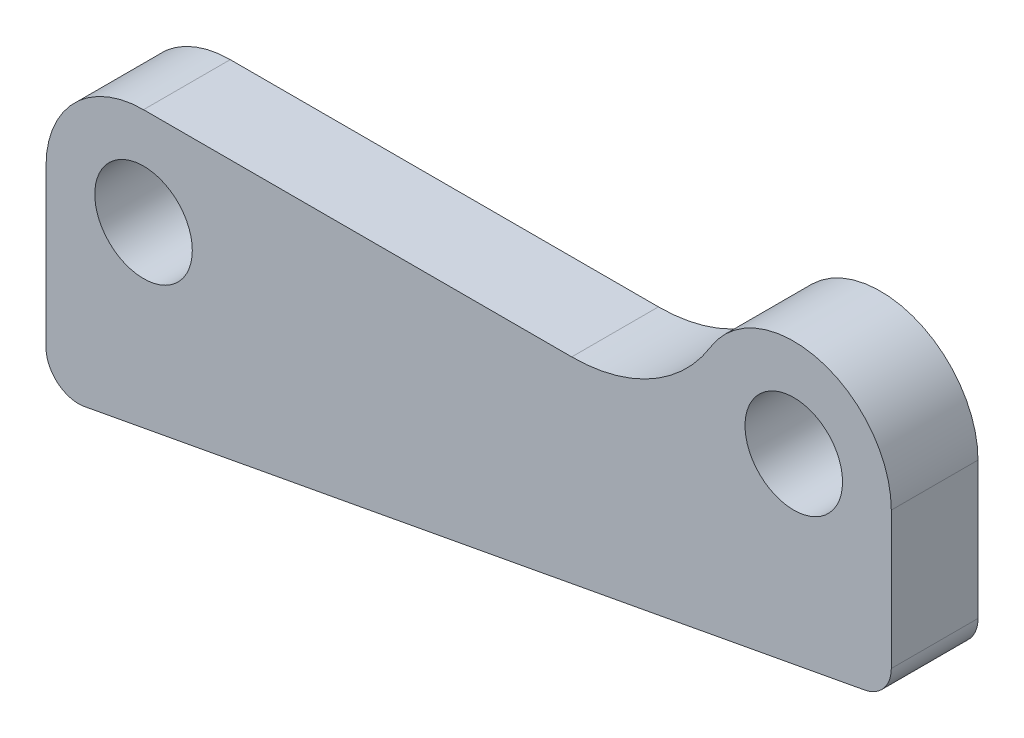
ISO-10303-21;
HEADER;
FILE_DESCRIPTION(('STEP AP214'),'2;1');
FILE_NAME('part.step','',(''),(''),'','','');
FILE_SCHEMA(('AUTOMOTIVE_DESIGN { 1 0 10303 214 1 1 1 1 }'));
ENDSEC;
DATA;
#1=APPLICATION_CONTEXT('core data for automotive mechanical design processes');
#2=APPLICATION_PROTOCOL_DEFINITION('international standard','automotive_design',2000,#1);
#3=PRODUCT_CONTEXT('',#1,'mechanical');
#4=PRODUCT('Part','Part','',(#3));
#5=PRODUCT_RELATED_PRODUCT_CATEGORY('part','',(#4));
#6=PRODUCT_DEFINITION_FORMATION('','',#4);
#7=PRODUCT_DEFINITION_CONTEXT('part definition',#1,'design');
#8=PRODUCT_DEFINITION('design','',#6,#7);
#9=PRODUCT_DEFINITION_SHAPE('','',#8);
#10=(LENGTH_UNIT() NAMED_UNIT(*) SI_UNIT(.MILLI.,.METRE.));
#11=(NAMED_UNIT(*) PLANE_ANGLE_UNIT() SI_UNIT($,.RADIAN.));
#12=(NAMED_UNIT(*) SI_UNIT($,.STERADIAN.) SOLID_ANGLE_UNIT());
#13=UNCERTAINTY_MEASURE_WITH_UNIT(LENGTH_MEASURE(1.E-05),#10,'distance_accuracy_value','');
#14=(GEOMETRIC_REPRESENTATION_CONTEXT(3) GLOBAL_UNCERTAINTY_ASSIGNED_CONTEXT((#13)) GLOBAL_UNIT_ASSIGNED_CONTEXT((#10,
#11,#12)) REPRESENTATION_CONTEXT('',''));
#15=CARTESIAN_POINT('',(0.,0.,0.));
#16=DIRECTION('',(0.,0.,1.));
#17=DIRECTION('',(1.,0.,0.));
#18=AXIS2_PLACEMENT_3D('',#15,#16,#17);
#19=CARTESIAN_POINT('',(-6.,-14.5,8.));
#20=DIRECTION('',(0.,0.,1.));
#21=DIRECTION('',(1.,0.,0.));
#22=AXIS2_PLACEMENT_3D('',#19,#20,#21);
#23=PLANE('',#22);
#24=CARTESIAN_POINT('',(0.,0.,8.));
#25=DIRECTION('',(0.,0.,1.));
#26=DIRECTION('',(1.,0.,0.));
#27=AXIS2_PLACEMENT_3D('',#24,#25,#26);
#28=CIRCLE('',#27,4.5);
#29=CARTESIAN_POINT('',(4.5,0.,8.));
#30=VERTEX_POINT('',#29);
#31=EDGE_CURVE('E146',#30,#30,#28,.T.);
#32=ORIENTED_EDGE('',*,*,#31,.F.);
#33=EDGE_LOOP('',(#32));
#34=FACE_BOUND('',#33,.T.);
#35=CARTESIAN_POINT('',(-6.,-14.5,8.));
#36=DIRECTION('',(0.,0.,1.));
#37=DIRECTION('',(1.,0.,0.));
#38=AXIS2_PLACEMENT_3D('',#35,#36,#37);
#39=CIRCLE('',#38,3.);
#40=CARTESIAN_POINT('',(-9.,-14.5,8.));
#41=VERTEX_POINT('',#40);
#42=CARTESIAN_POINT('',(-5.45329342352354,-17.4497647226919,8.));
#43=VERTEX_POINT('',#42);
#44=EDGE_CURVE('E159',#41,#43,#39,.T.);
#45=ORIENTED_EDGE('',*,*,#44,.T.);
#46=DIRECTION('',(0.983254907563954,0.182235525492151,0.));
#47=VECTOR('',#46,1.);
#48=CARTESIAN_POINT('',(-5.45329342352354,-17.4497647226919,8.));
#49=LINE('',#48,#47);
#50=CARTESIAN_POINT('',(66.5467065764764,-4.1053534876211,8.));
#51=VERTEX_POINT('',#50);
#52=EDGE_CURVE('E102',#43,#51,#49,.T.);
#53=ORIENTED_EDGE('',*,*,#52,.T.);
#54=CARTESIAN_POINT('',(66.,-1.15558876492923,8.));
#55=DIRECTION('',(0.,0.,1.));
#56=DIRECTION('',(1.,0.,0.));
#57=AXIS2_PLACEMENT_3D('',#54,#55,#56);
#58=CIRCLE('',#57,3.00000000000001);
#59=CARTESIAN_POINT('',(69.,-1.15558876492923,8.));
#60=VERTEX_POINT('',#59);
#61=EDGE_CURVE('E177',#51,#60,#58,.T.);
#62=ORIENTED_EDGE('',*,*,#61,.T.);
#63=DIRECTION('',(0.,1.,0.));
#64=VECTOR('',#63,1.);
#65=CARTESIAN_POINT('',(69.,-1.15558876492923,8.));
#66=LINE('',#65,#64);
#67=CARTESIAN_POINT('',(69.,11.5,8.));
#68=VERTEX_POINT('',#67);
#69=EDGE_CURVE('E194',#60,#68,#66,.T.);
#70=ORIENTED_EDGE('',*,*,#69,.T.);
#71=CARTESIAN_POINT('',(60.,11.5,8.));
#72=DIRECTION('',(0.,0.,1.));
#73=DIRECTION('',(1.,0.,0.));
#74=AXIS2_PLACEMENT_3D('',#71,#72,#73);
#75=CIRCLE('',#74,8.99999999999999);
#76=CARTESIAN_POINT('',(52.3170745317946,16.1875,8.));
#77=VERTEX_POINT('',#76);
#78=EDGE_CURVE('E193',#68,#77,#75,.T.);
#79=ORIENTED_EDGE('',*,*,#78,.T.);
#80=CARTESIAN_POINT('',(39.5121987514521,24.,8.));
#81=DIRECTION('',(0.,0.,-1.));
#82=DIRECTION('',(-1.,0.,0.));
#83=AXIS2_PLACEMENT_3D('',#80,#81,#82);
#84=CIRCLE('',#83,15.);
#85=CARTESIAN_POINT('',(39.5121987514521,9.00000000000001,8.));
#86=VERTEX_POINT('',#85);
#87=EDGE_CURVE('E124',#77,#86,#84,.T.);
#88=ORIENTED_EDGE('',*,*,#87,.T.);
#89=DIRECTION('',(-1.,0.,0.));
#90=VECTOR('',#89,1.);
#91=CARTESIAN_POINT('',(39.5121987514521,9.00000000000001,8.));
#92=LINE('',#91,#90);
#93=CARTESIAN_POINT('',(0.,9.,8.));
#94=VERTEX_POINT('',#93);
#95=EDGE_CURVE('E118',#86,#94,#92,.T.);
#96=ORIENTED_EDGE('',*,*,#95,.T.);
#97=CARTESIAN_POINT('',(0.,0.,8.));
#98=DIRECTION('',(0.,0.,1.));
#99=DIRECTION('',(1.,0.,0.));
#100=AXIS2_PLACEMENT_3D('',#97,#98,#99);
#101=CIRCLE('',#100,9.);
#102=CARTESIAN_POINT('',(-9.,0.,8.));
#103=VERTEX_POINT('',#102);
#104=EDGE_CURVE('E122',#94,#103,#101,.T.);
#105=ORIENTED_EDGE('',*,*,#104,.T.);
#106=DIRECTION('',(0.,-1.,0.));
#107=VECTOR('',#106,1.);
#108=CARTESIAN_POINT('',(-9.,0.,8.));
#109=LINE('',#108,#107);
#110=EDGE_CURVE('E56',#103,#41,#109,.T.);
#111=ORIENTED_EDGE('',*,*,#110,.T.);
#112=EDGE_LOOP('',(#45,#53,#62,#70,#79,#88,#96,#105,#111));
#113=FACE_BOUND('',#112,.T.);
#114=CARTESIAN_POINT('',(60.,11.5,8.));
#115=DIRECTION('',(0.,0.,1.));
#116=DIRECTION('',(1.,0.,0.));
#117=AXIS2_PLACEMENT_3D('',#114,#115,#116);
#118=CIRCLE('',#117,4.5);
#119=CARTESIAN_POINT('',(64.5,11.5,8.));
#120=VERTEX_POINT('',#119);
#121=EDGE_CURVE('E204',#120,#120,#118,.T.);
#122=ORIENTED_EDGE('',*,*,#121,.F.);
#123=EDGE_LOOP('',(#122));
#124=FACE_BOUND('',#123,.T.);
#125=ADVANCED_FACE('F39',(#34,#113,#124),#23,.T.);
#126=CARTESIAN_POINT('',(-6.,-14.5,0.));
#127=DIRECTION('',(0.,0.,1.));
#128=DIRECTION('',(1.,0.,0.));
#129=AXIS2_PLACEMENT_3D('',#126,#127,#128);
#130=PLANE('',#129);
#131=CARTESIAN_POINT('',(0.,0.,0.));
#132=DIRECTION('',(0.,0.,1.));
#133=DIRECTION('',(1.,0.,0.));
#134=AXIS2_PLACEMENT_3D('',#131,#132,#133);
#135=CIRCLE('',#134,4.5);
#136=CARTESIAN_POINT('',(4.5,0.,0.));
#137=VERTEX_POINT('',#136);
#138=EDGE_CURVE('E201',#137,#137,#135,.T.);
#139=ORIENTED_EDGE('',*,*,#138,.T.);
#140=EDGE_LOOP('',(#139));
#141=FACE_BOUND('',#140,.T.);
#142=CARTESIAN_POINT('',(-6.,-14.5,0.));
#143=DIRECTION('',(0.,0.,1.));
#144=DIRECTION('',(1.,0.,0.));
#145=AXIS2_PLACEMENT_3D('',#142,#143,#144);
#146=CIRCLE('',#145,3.);
#147=CARTESIAN_POINT('',(-9.,-14.5,0.));
#148=VERTEX_POINT('',#147);
#149=CARTESIAN_POINT('',(-5.45329342352354,-17.4497647226919,0.));
#150=VERTEX_POINT('',#149);
#151=EDGE_CURVE('E142',#148,#150,#146,.T.);
#152=ORIENTED_EDGE('',*,*,#151,.F.);
#153=DIRECTION('',(0.,-1.,0.));
#154=VECTOR('',#153,1.);
#155=CARTESIAN_POINT('',(-9.,0.,0.));
#156=LINE('',#155,#154);
#157=CARTESIAN_POINT('',(-9.,0.,0.));
#158=VERTEX_POINT('',#157);
#159=EDGE_CURVE('E94',#158,#148,#156,.T.);
#160=ORIENTED_EDGE('',*,*,#159,.F.);
#161=CARTESIAN_POINT('',(0.,0.,0.));
#162=DIRECTION('',(0.,0.,1.));
#163=DIRECTION('',(1.,0.,0.));
#164=AXIS2_PLACEMENT_3D('',#161,#162,#163);
#165=CIRCLE('',#164,9.);
#166=CARTESIAN_POINT('',(0.,9.,0.));
#167=VERTEX_POINT('',#166);
#168=EDGE_CURVE('E88',#167,#158,#165,.T.);
#169=ORIENTED_EDGE('',*,*,#168,.F.);
#170=DIRECTION('',(-1.,0.,0.));
#171=VECTOR('',#170,1.);
#172=CARTESIAN_POINT('',(39.5121987514521,9.00000000000001,0.));
#173=LINE('',#172,#171);
#174=CARTESIAN_POINT('',(39.5121987514521,9.00000000000001,0.));
#175=VERTEX_POINT('',#174);
#176=EDGE_CURVE('E132',#175,#167,#173,.T.);
#177=ORIENTED_EDGE('',*,*,#176,.F.);
#178=CARTESIAN_POINT('',(39.5121987514521,24.,0.));
#179=DIRECTION('',(0.,0.,-1.));
#180=DIRECTION('',(-1.,0.,0.));
#181=AXIS2_PLACEMENT_3D('',#178,#179,#180);
#182=CIRCLE('',#181,15.);
#183=CARTESIAN_POINT('',(52.3170745317946,16.1875,0.));
#184=VERTEX_POINT('',#183);
#185=EDGE_CURVE('E154',#184,#175,#182,.T.);
#186=ORIENTED_EDGE('',*,*,#185,.F.);
#187=CARTESIAN_POINT('',(60.,11.5,0.));
#188=DIRECTION('',(0.,0.,1.));
#189=DIRECTION('',(1.,0.,0.));
#190=AXIS2_PLACEMENT_3D('',#187,#188,#189);
#191=CIRCLE('',#190,8.99999999999999);
#192=CARTESIAN_POINT('',(69.,11.5,0.));
#193=VERTEX_POINT('',#192);
#194=EDGE_CURVE('E152',#193,#184,#191,.T.);
#195=ORIENTED_EDGE('',*,*,#194,.F.);
#196=DIRECTION('',(0.,1.,0.));
#197=VECTOR('',#196,1.);
#198=CARTESIAN_POINT('',(69.,-1.15558876492923,0.));
#199=LINE('',#198,#197);
#200=CARTESIAN_POINT('',(69.,-1.15558876492923,0.));
#201=VERTEX_POINT('',#200);
#202=EDGE_CURVE('E150',#201,#193,#199,.T.);
#203=ORIENTED_EDGE('',*,*,#202,.F.);
#204=CARTESIAN_POINT('',(66.,-1.15558876492923,0.));
#205=DIRECTION('',(0.,0.,1.));
#206=DIRECTION('',(1.,0.,0.));
#207=AXIS2_PLACEMENT_3D('',#204,#205,#206);
#208=CIRCLE('',#207,3.00000000000001);
#209=CARTESIAN_POINT('',(66.5467065764764,-4.1053534876211,0.));
#210=VERTEX_POINT('',#209);
#211=EDGE_CURVE('E148',#210,#201,#208,.T.);
#212=ORIENTED_EDGE('',*,*,#211,.F.);
#213=DIRECTION('',(0.983254907563954,0.182235525492151,0.));
#214=VECTOR('',#213,1.);
#215=CARTESIAN_POINT('',(-5.45329342352354,-17.4497647226919,0.));
#216=LINE('',#215,#214);
#217=EDGE_CURVE('E145',#150,#210,#216,.T.);
#218=ORIENTED_EDGE('',*,*,#217,.F.);
#219=EDGE_LOOP('',(#152,#160,#169,#177,#186,#195,#203,#212,#218));
#220=FACE_BOUND('',#219,.T.);
#221=CARTESIAN_POINT('',(60.,11.5,0.));
#222=DIRECTION('',(0.,0.,1.));
#223=DIRECTION('',(1.,0.,0.));
#224=AXIS2_PLACEMENT_3D('',#221,#222,#223);
#225=CIRCLE('',#224,4.5);
#226=CARTESIAN_POINT('',(64.5,11.5,0.));
#227=VERTEX_POINT('',#226);
#228=EDGE_CURVE('E207',#227,#227,#225,.T.);
#229=ORIENTED_EDGE('',*,*,#228,.T.);
#230=EDGE_LOOP('',(#229));
#231=FACE_BOUND('',#230,.T.);
#232=ADVANCED_FACE('F181',(#141,#220,#231),#130,.F.);
#233=CARTESIAN_POINT('',(-6.,-14.5,8.));
#234=DIRECTION('',(0.,0.,-1.));
#235=DIRECTION('',(-1.,0.,0.));
#236=AXIS2_PLACEMENT_3D('',#233,#234,#235);
#237=CYLINDRICAL_SURFACE('',#236,3.);
#238=ORIENTED_EDGE('',*,*,#151,.T.);
#239=DIRECTION('',(0.,0.,-1.));
#240=VECTOR('',#239,1.);
#241=CARTESIAN_POINT('',(-5.45329342352354,-17.4497647226919,8.));
#242=LINE('',#241,#240);
#243=EDGE_CURVE('E11',#43,#150,#242,.T.);
#244=ORIENTED_EDGE('',*,*,#243,.F.);
#245=ORIENTED_EDGE('',*,*,#44,.F.);
#246=DIRECTION('',(0.,0.,-1.));
#247=VECTOR('',#246,1.);
#248=CARTESIAN_POINT('',(-9.,-14.5,8.));
#249=LINE('',#248,#247);
#250=EDGE_CURVE('E138',#41,#148,#249,.T.);
#251=ORIENTED_EDGE('',*,*,#250,.T.);
#252=EDGE_LOOP('',(#238,#244,#245,#251));
#253=FACE_BOUND('',#252,.T.);
#254=ADVANCED_FACE('F41',(#253),#237,.T.);
#255=CARTESIAN_POINT('',(-5.45329342352354,-17.4497647226919,8.));
#256=DIRECTION('',(-0.182235525492151,0.983254907563954,0.));
#257=DIRECTION('',(-0.983254907563954,-0.182235525492151,0.));
#258=AXIS2_PLACEMENT_3D('',#255,#256,#257);
#259=PLANE('',#258);
#260=ORIENTED_EDGE('',*,*,#217,.T.);
#261=DIRECTION('',(0.,0.,-1.));
#262=VECTOR('',#261,1.);
#263=CARTESIAN_POINT('',(66.5467065764764,-4.1053534876211,8.));
#264=LINE('',#263,#262);
#265=EDGE_CURVE('E48',#51,#210,#264,.T.);
#266=ORIENTED_EDGE('',*,*,#265,.F.);
#267=ORIENTED_EDGE('',*,*,#52,.F.);
#268=ORIENTED_EDGE('',*,*,#243,.T.);
#269=EDGE_LOOP('',(#260,#266,#267,#268));
#270=FACE_BOUND('',#269,.T.);
#271=ADVANCED_FACE('F244',(#270),#259,.F.);
#272=CARTESIAN_POINT('',(66.,-1.15558876492923,8.));
#273=DIRECTION('',(0.,0.,-1.));
#274=DIRECTION('',(-1.,0.,0.));
#275=AXIS2_PLACEMENT_3D('',#272,#273,#274);
#276=CYLINDRICAL_SURFACE('',#275,3.00000000000001);
#277=ORIENTED_EDGE('',*,*,#211,.T.);
#278=DIRECTION('',(0.,0.,-1.));
#279=VECTOR('',#278,1.);
#280=CARTESIAN_POINT('',(69.,-1.15558876492923,8.));
#281=LINE('',#280,#279);
#282=EDGE_CURVE('E169',#60,#201,#281,.T.);
#283=ORIENTED_EDGE('',*,*,#282,.F.);
#284=ORIENTED_EDGE('',*,*,#61,.F.);
#285=ORIENTED_EDGE('',*,*,#265,.T.);
#286=EDGE_LOOP('',(#277,#283,#284,#285));
#287=FACE_BOUND('',#286,.T.);
#288=ADVANCED_FACE('F175',(#287),#276,.T.);
#289=CARTESIAN_POINT('',(69.,-1.15558876492923,8.));
#290=DIRECTION('',(-1.,0.,0.));
#291=DIRECTION('',(0.,0.,1.));
#292=AXIS2_PLACEMENT_3D('',#289,#290,#291);
#293=PLANE('',#292);
#294=ORIENTED_EDGE('',*,*,#202,.T.);
#295=DIRECTION('',(0.,0.,-1.));
#296=VECTOR('',#295,1.);
#297=CARTESIAN_POINT('',(69.,11.5,8.));
#298=LINE('',#297,#296);
#299=EDGE_CURVE('E166',#68,#193,#298,.T.);
#300=ORIENTED_EDGE('',*,*,#299,.F.);
#301=ORIENTED_EDGE('',*,*,#69,.F.);
#302=ORIENTED_EDGE('',*,*,#282,.T.);
#303=EDGE_LOOP('',(#294,#300,#301,#302));
#304=FACE_BOUND('',#303,.T.);
#305=ADVANCED_FACE('F187',(#304),#293,.F.);
#306=CARTESIAN_POINT('',(60.,11.5,8.));
#307=DIRECTION('',(0.,0.,-1.));
#308=DIRECTION('',(-1.,0.,0.));
#309=AXIS2_PLACEMENT_3D('',#306,#307,#308);
#310=CYLINDRICAL_SURFACE('',#309,8.99999999999999);
#311=ORIENTED_EDGE('',*,*,#194,.T.);
#312=DIRECTION('',(0.,0.,-1.));
#313=VECTOR('',#312,1.);
#314=CARTESIAN_POINT('',(52.3170745317946,16.1875,8.));
#315=LINE('',#314,#313);
#316=EDGE_CURVE('E163',#77,#184,#315,.T.);
#317=ORIENTED_EDGE('',*,*,#316,.F.);
#318=ORIENTED_EDGE('',*,*,#78,.F.);
#319=ORIENTED_EDGE('',*,*,#299,.T.);
#320=EDGE_LOOP('',(#311,#317,#318,#319));
#321=FACE_BOUND('',#320,.T.);
#322=ADVANCED_FACE('F191',(#321),#310,.T.);
#323=CARTESIAN_POINT('',(39.5121987514521,24.,8.));
#324=DIRECTION('',(0.,0.,-1.));
#325=DIRECTION('',(-1.,0.,0.));
#326=AXIS2_PLACEMENT_3D('',#323,#324,#325);
#327=CYLINDRICAL_SURFACE('',#326,15.);
#328=ORIENTED_EDGE('',*,*,#185,.T.);
#329=DIRECTION('',(0.,0.,-1.));
#330=VECTOR('',#329,1.);
#331=CARTESIAN_POINT('',(39.5121987514521,9.00000000000001,8.));
#332=LINE('',#331,#330);
#333=EDGE_CURVE('E133',#86,#175,#332,.T.);
#334=ORIENTED_EDGE('',*,*,#333,.F.);
#335=ORIENTED_EDGE('',*,*,#87,.F.);
#336=ORIENTED_EDGE('',*,*,#316,.T.);
#337=EDGE_LOOP('',(#328,#334,#335,#336));
#338=FACE_BOUND('',#337,.T.);
#339=ADVANCED_FACE('F235',(#338),#327,.F.);
#340=CARTESIAN_POINT('',(39.5121987514521,9.00000000000001,8.));
#341=DIRECTION('',(0.,-1.,0.));
#342=DIRECTION('',(1.,0.,0.));
#343=AXIS2_PLACEMENT_3D('',#340,#341,#342);
#344=PLANE('',#343);
#345=ORIENTED_EDGE('',*,*,#176,.T.);
#346=DIRECTION('',(0.,0.,-1.));
#347=VECTOR('',#346,1.);
#348=CARTESIAN_POINT('',(0.,9.,8.));
#349=LINE('',#348,#347);
#350=EDGE_CURVE('E129',#94,#167,#349,.T.);
#351=ORIENTED_EDGE('',*,*,#350,.F.);
#352=ORIENTED_EDGE('',*,*,#95,.F.);
#353=ORIENTED_EDGE('',*,*,#333,.T.);
#354=EDGE_LOOP('',(#345,#351,#352,#353));
#355=FACE_BOUND('',#354,.T.);
#356=ADVANCED_FACE('F130',(#355),#344,.F.);
#357=CARTESIAN_POINT('',(0.,0.,8.));
#358=DIRECTION('',(0.,0.,-1.));
#359=DIRECTION('',(-1.,0.,0.));
#360=AXIS2_PLACEMENT_3D('',#357,#358,#359);
#361=CYLINDRICAL_SURFACE('',#360,9.);
#362=ORIENTED_EDGE('',*,*,#168,.T.);
#363=DIRECTION('',(0.,0.,-1.));
#364=VECTOR('',#363,1.);
#365=CARTESIAN_POINT('',(-9.,0.,8.));
#366=LINE('',#365,#364);
#367=EDGE_CURVE('E134',#103,#158,#366,.T.);
#368=ORIENTED_EDGE('',*,*,#367,.F.);
#369=ORIENTED_EDGE('',*,*,#104,.F.);
#370=ORIENTED_EDGE('',*,*,#350,.T.);
#371=EDGE_LOOP('',(#362,#368,#369,#370));
#372=FACE_BOUND('',#371,.T.);
#373=ADVANCED_FACE('F136',(#372),#361,.T.);
#374=CARTESIAN_POINT('',(-9.,0.,8.));
#375=DIRECTION('',(1.,0.,0.));
#376=DIRECTION('',(0.,1.,0.));
#377=AXIS2_PLACEMENT_3D('',#374,#375,#376);
#378=PLANE('',#377);
#379=ORIENTED_EDGE('',*,*,#159,.T.);
#380=ORIENTED_EDGE('',*,*,#250,.F.);
#381=ORIENTED_EDGE('',*,*,#110,.F.);
#382=ORIENTED_EDGE('',*,*,#367,.T.);
#383=EDGE_LOOP('',(#379,#380,#381,#382));
#384=FACE_BOUND('',#383,.T.);
#385=ADVANCED_FACE('F228',(#384),#378,.F.);
#386=CARTESIAN_POINT('',(0.,0.,8.));
#387=DIRECTION('',(0.,0.,-1.));
#388=DIRECTION('',(-1.,0.,0.));
#389=AXIS2_PLACEMENT_3D('',#386,#387,#388);
#390=CYLINDRICAL_SURFACE('',#389,4.5);
#391=ORIENTED_EDGE('',*,*,#31,.T.);
#392=EDGE_LOOP('',(#391));
#393=FACE_BOUND('',#392,.T.);
#394=ORIENTED_EDGE('',*,*,#138,.F.);
#395=EDGE_LOOP('',(#394));
#396=FACE_BOUND('',#395,.T.);
#397=ADVANCED_FACE('F225',(#393,#396),#390,.F.);
#398=CARTESIAN_POINT('',(60.,11.5,8.));
#399=DIRECTION('',(0.,0.,-1.));
#400=DIRECTION('',(-1.,0.,0.));
#401=AXIS2_PLACEMENT_3D('',#398,#399,#400);
#402=CYLINDRICAL_SURFACE('',#401,4.5);
#403=ORIENTED_EDGE('',*,*,#121,.T.);
#404=EDGE_LOOP('',(#403));
#405=FACE_BOUND('',#404,.T.);
#406=ORIENTED_EDGE('',*,*,#228,.F.);
#407=EDGE_LOOP('',(#406));
#408=FACE_BOUND('',#407,.T.);
#409=ADVANCED_FACE('F213',(#405,#408),#402,.F.);
#410=CLOSED_SHELL('',(#125,#232,#254,#271,#288,#305,#322,#339,#356,#373,#385,#397,#409));
#411=MANIFOLD_SOLID_BREP('B2',#410);
#412=ADVANCED_BREP_SHAPE_REPRESENTATION('',(#18,#411),#14);
#413=SHAPE_DEFINITION_REPRESENTATION(#9,#412);
ENDSEC;
END-ISO-10303-21;
